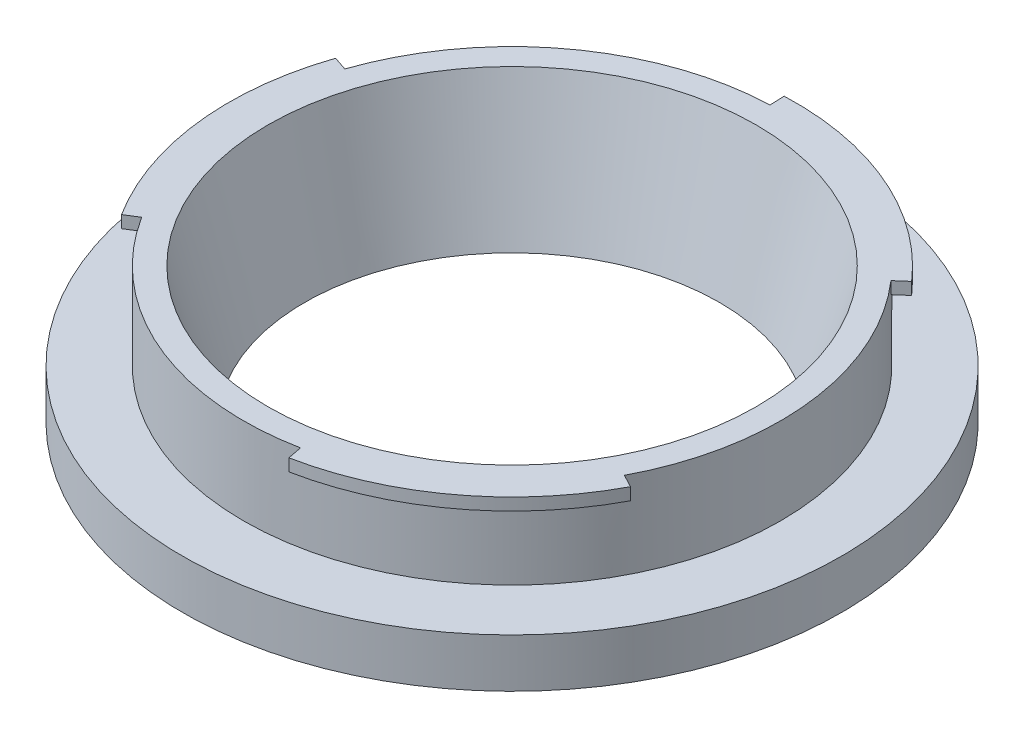
ISO-10303-21;
HEADER;
FILE_DESCRIPTION(('STEP AP214'),'2;1');
FILE_NAME('part.step','',(''),(''),'','','');
FILE_SCHEMA(('AUTOMOTIVE_DESIGN { 1 0 10303 214 1 1 1 1 }'));
ENDSEC;
DATA;
#1=APPLICATION_CONTEXT('core data for automotive mechanical design processes');
#2=APPLICATION_PROTOCOL_DEFINITION('international standard','automotive_design',2000,#1);
#3=PRODUCT_CONTEXT('',#1,'mechanical');
#4=PRODUCT('Part','Part','',(#3));
#5=PRODUCT_RELATED_PRODUCT_CATEGORY('part','',(#4));
#6=PRODUCT_DEFINITION_FORMATION('','',#4);
#7=PRODUCT_DEFINITION_CONTEXT('part definition',#1,'design');
#8=PRODUCT_DEFINITION('design','',#6,#7);
#9=PRODUCT_DEFINITION_SHAPE('','',#8);
#10=(LENGTH_UNIT() NAMED_UNIT(*) SI_UNIT(.MILLI.,.METRE.));
#11=(NAMED_UNIT(*) PLANE_ANGLE_UNIT() SI_UNIT($,.RADIAN.));
#12=(NAMED_UNIT(*) SI_UNIT($,.STERADIAN.) SOLID_ANGLE_UNIT());
#13=UNCERTAINTY_MEASURE_WITH_UNIT(LENGTH_MEASURE(1.E-05),#10,'distance_accuracy_value','');
#14=(GEOMETRIC_REPRESENTATION_CONTEXT(3) GLOBAL_UNCERTAINTY_ASSIGNED_CONTEXT((#13)) GLOBAL_UNIT_ASSIGNED_CONTEXT((#10,
#11,#12)) REPRESENTATION_CONTEXT('',''));
#15=CARTESIAN_POINT('',(0.,0.,0.));
#16=DIRECTION('',(0.,0.,1.));
#17=DIRECTION('',(1.,0.,0.));
#18=AXIS2_PLACEMENT_3D('',#15,#16,#17);
#19=CARTESIAN_POINT('',(0.,10.1,0.));
#20=DIRECTION('',(0.,-1.,0.));
#21=DIRECTION('',(0.,0.,-1.));
#22=AXIS2_PLACEMENT_3D('',#19,#20,#21);
#23=PLANE('',#22);
#24=CARTESIAN_POINT('',(0.,10.1,0.));
#25=DIRECTION('',(0.,-1.,0.));
#26=DIRECTION('',(0.,0.,-1.));
#27=AXIS2_PLACEMENT_3D('',#24,#25,#26);
#28=CIRCLE('',#27,22.);
#29=CARTESIAN_POINT('',(-0.844531799925527,10.1,-21.9837841610337));
#30=VERTEX_POINT('',#29);
#31=CARTESIAN_POINT('',(16.5699252925209,10.1,-14.4719582572738));
#32=VERTEX_POINT('',#31);
#33=EDGE_CURVE('E141',#30,#32,#28,.T.);
#34=ORIENTED_EDGE('',*,*,#33,.F.);
#35=DIRECTION('',(0.0383878090875239,0.,0.999262916410621));
#36=VECTOR('',#35,1.);
#37=CARTESIAN_POINT('',(0.,10.1,0.));
#38=LINE('',#37,#36);
#39=CARTESIAN_POINT('',(-0.890597170830556,10.1,-23.1828996607264));
#40=VERTEX_POINT('',#39);
#41=EDGE_CURVE('E126',#40,#30,#38,.T.);
#42=ORIENTED_EDGE('',*,*,#41,.F.);
#43=CARTESIAN_POINT('',(0.,10.1,0.));
#44=DIRECTION('',(0.,-1.,0.));
#45=DIRECTION('',(0.,0.,-1.));
#46=AXIS2_PLACEMENT_3D('',#43,#44,#45);
#47=CIRCLE('',#46,23.2);
#48=CARTESIAN_POINT('',(17.4737393993857,10.1,-15.2613377985796));
#49=VERTEX_POINT('',#48);
#50=EDGE_CURVE('E155',#40,#49,#47,.T.);
#51=ORIENTED_EDGE('',*,*,#50,.T.);
#52=DIRECTION('',(-0.753178422387314,0.,0.657816284421538));
#53=VECTOR('',#52,1.);
#54=CARTESIAN_POINT('',(0.,10.1,0.));
#55=LINE('',#54,#53);
#56=EDGE_CURVE('E146',#49,#32,#55,.T.);
#57=ORIENTED_EDGE('',*,*,#56,.T.);
#58=EDGE_LOOP('',(#34,#42,#51,#57));
#59=FACE_BOUND('',#58,.T.);
#60=ADVANCED_FACE('F37',(#59),#23,.T.);
#61=CARTESIAN_POINT('',(0.,0.,0.));
#62=DIRECTION('',(0.,-1.,0.));
#63=DIRECTION('',(0.,0.,-1.));
#64=AXIS2_PLACEMENT_3D('',#61,#62,#63);
#65=CYLINDRICAL_SURFACE('',#64,23.2);
#66=DIRECTION('',(0.,1.,0.));
#67=VECTOR('',#66,1.);
#68=CARTESIAN_POINT('',(-0.890597170830556,10.1,-23.1828996607264));
#69=LINE('',#68,#67);
#70=CARTESIAN_POINT('',(-0.890597170830556,11.1,-23.1828996607264));
#71=VERTEX_POINT('',#70);
#72=EDGE_CURVE('E131',#40,#71,#69,.T.);
#73=ORIENTED_EDGE('',*,*,#72,.T.);
#74=CARTESIAN_POINT('',(0.,11.1,0.));
#75=DIRECTION('',(0.,-1.,0.));
#76=DIRECTION('',(0.,0.,-1.));
#77=AXIS2_PLACEMENT_3D('',#74,#75,#76);
#78=CIRCLE('',#77,23.2);
#79=CARTESIAN_POINT('',(17.4737393993857,11.1,-15.2613377985796));
#80=VERTEX_POINT('',#79);
#81=EDGE_CURVE('E254',#71,#80,#78,.T.);
#82=ORIENTED_EDGE('',*,*,#81,.T.);
#83=DIRECTION('',(0.,1.,0.));
#84=VECTOR('',#83,1.);
#85=CARTESIAN_POINT('',(17.4737393993857,10.1,-15.2613377985796));
#86=LINE('',#85,#84);
#87=EDGE_CURVE('E241',#49,#80,#86,.T.);
#88=ORIENTED_EDGE('',*,*,#87,.F.);
#89=ORIENTED_EDGE('',*,*,#50,.F.);
#90=EDGE_LOOP('',(#73,#82,#88,#89));
#91=FACE_BOUND('',#90,.T.);
#92=ADVANCED_FACE('F179',(#91),#65,.T.);
#93=DIRECTION('',(0.946274824525796,0.,0.323363505158938));
#94=VECTOR('',#93,1.);
#95=CARTESIAN_POINT('',(0.,10.1,0.));
#96=LINE('',#95,#94);
#97=CARTESIAN_POINT('',(-21.9535759289984,10.1,-7.50203331968743));
#98=VERTEX_POINT('',#97);
#99=CARTESIAN_POINT('',(-20.8180461395675,10.1,-7.11399711349671));
#100=VERTEX_POINT('',#99);
#101=EDGE_CURVE('E135',#98,#100,#96,.T.);
#102=ORIENTED_EDGE('',*,*,#101,.T.);
#103=CARTESIAN_POINT('',(-18.6162496548065,10.1,11.723278073556));
#104=VERTEX_POINT('',#103);
#105=EDGE_CURVE('E147',#104,#100,#28,.T.);
#106=ORIENTED_EDGE('',*,*,#105,.F.);
#107=DIRECTION('',(0.846193166127566,0.,-0.532876276070727));
#108=VECTOR('',#107,1.);
#109=CARTESIAN_POINT('',(0.,10.1,0.));
#110=LINE('',#109,#108);
#111=CARTESIAN_POINT('',(-19.6316814541596,10.1,12.3627296048408));
#112=VERTEX_POINT('',#111);
#113=EDGE_CURVE('E205',#112,#104,#110,.T.);
#114=ORIENTED_EDGE('',*,*,#113,.F.);
#115=EDGE_CURVE('E153',#112,#98,#47,.T.);
#116=ORIENTED_EDGE('',*,*,#115,.T.);
#117=EDGE_LOOP('',(#102,#106,#114,#116));
#118=FACE_BOUND('',#117,.T.);
#119=ADVANCED_FACE('F181',(#118),#23,.T.);
#120=CARTESIAN_POINT('',(-19.6316814541596,11.1,12.3627296048408));
#121=VERTEX_POINT('',#120);
#122=CARTESIAN_POINT('',(-21.9535759289984,11.1,-7.50203331968743));
#123=VERTEX_POINT('',#122);
#124=EDGE_CURVE('E257',#121,#123,#78,.T.);
#125=ORIENTED_EDGE('',*,*,#124,.T.);
#126=DIRECTION('',(0.,1.,0.));
#127=VECTOR('',#126,1.);
#128=CARTESIAN_POINT('',(-21.9535759289984,10.1,-7.50203331968743));
#129=LINE('',#128,#127);
#130=EDGE_CURVE('E280',#98,#123,#129,.T.);
#131=ORIENTED_EDGE('',*,*,#130,.F.);
#132=ORIENTED_EDGE('',*,*,#115,.F.);
#133=DIRECTION('',(0.,1.,0.));
#134=VECTOR('',#133,1.);
#135=CARTESIAN_POINT('',(-19.6316814541596,10.1,12.3627296048408));
#136=LINE('',#135,#134);
#137=EDGE_CURVE('E207',#112,#121,#136,.T.);
#138=ORIENTED_EDGE('',*,*,#137,.T.);
#139=EDGE_LOOP('',(#125,#131,#132,#138));
#140=FACE_BOUND('',#139,.T.);
#141=ADVANCED_FACE('F187',(#140),#65,.T.);
#142=CARTESIAN_POINT('',(0.,0.,0.));
#143=DIRECTION('',(0.,-1.,0.));
#144=DIRECTION('',(0.,0.,-1.));
#145=AXIS2_PLACEMENT_3D('',#142,#143,#144);
#146=PLANE('',#145);
#147=CARTESIAN_POINT('',(0.,0.,0.));
#148=DIRECTION('',(0.,-1.,0.));
#149=DIRECTION('',(0.,0.,-1.));
#150=AXIS2_PLACEMENT_3D('',#147,#148,#149);
#151=CIRCLE('',#150,27.);
#152=CARTESIAN_POINT('',(0.,0.,-27.));
#153=VERTEX_POINT('',#152);
#154=EDGE_CURVE('E11',#153,#153,#151,.T.);
#155=ORIENTED_EDGE('',*,*,#154,.T.);
#156=EDGE_LOOP('',(#155));
#157=FACE_BOUND('',#156,.T.);
#158=CARTESIAN_POINT('',(0.,0.,0.));
#159=DIRECTION('',(0.,-1.,0.));
#160=DIRECTION('',(0.,0.,-1.));
#161=AXIS2_PLACEMENT_3D('',#158,#159,#160);
#162=CIRCLE('',#161,17.);
#163=CARTESIAN_POINT('',(0.,0.,-17.));
#164=VERTEX_POINT('',#163);
#165=EDGE_CURVE('E240',#164,#164,#162,.T.);
#166=ORIENTED_EDGE('',*,*,#165,.F.);
#167=EDGE_LOOP('',(#166));
#168=FACE_BOUND('',#167,.T.);
#169=ADVANCED_FACE('F39',(#157,#168),#146,.T.);
#170=CARTESIAN_POINT('',(0.,0.,0.));
#171=DIRECTION('',(0.,-1.,0.));
#172=DIRECTION('',(0.,0.,-1.));
#173=AXIS2_PLACEMENT_3D('',#170,#171,#172);
#174=CYLINDRICAL_SURFACE('',#173,27.);
#175=CARTESIAN_POINT('',(0.,4.,0.));
#176=DIRECTION('',(0.,-1.,0.));
#177=DIRECTION('',(0.,0.,-1.));
#178=AXIS2_PLACEMENT_3D('',#175,#176,#177);
#179=CIRCLE('',#178,27.);
#180=CARTESIAN_POINT('',(0.,4.,-27.));
#181=VERTEX_POINT('',#180);
#182=EDGE_CURVE('E45',#181,#181,#179,.T.);
#183=ORIENTED_EDGE('',*,*,#182,.T.);
#184=EDGE_LOOP('',(#183));
#185=FACE_BOUND('',#184,.T.);
#186=ORIENTED_EDGE('',*,*,#154,.F.);
#187=EDGE_LOOP('',(#186));
#188=FACE_BOUND('',#187,.T.);
#189=ADVANCED_FACE('F166',(#185,#188),#174,.T.);
#190=CARTESIAN_POINT('',(0.,4.,0.));
#191=DIRECTION('',(0.,-1.,0.));
#192=DIRECTION('',(0.,0.,-1.));
#193=AXIS2_PLACEMENT_3D('',#190,#191,#192);
#194=PLANE('',#193);
#195=ORIENTED_EDGE('',*,*,#182,.F.);
#196=EDGE_LOOP('',(#195));
#197=FACE_BOUND('',#196,.T.);
#198=CARTESIAN_POINT('',(0.,4.,0.));
#199=DIRECTION('',(0.,-1.,0.));
#200=DIRECTION('',(0.,0.,-1.));
#201=AXIS2_PLACEMENT_3D('',#198,#199,#200);
#202=CIRCLE('',#201,22.);
#203=CARTESIAN_POINT('',(0.,4.,-22.));
#204=VERTEX_POINT('',#203);
#205=EDGE_CURVE('E157',#204,#204,#202,.T.);
#206=ORIENTED_EDGE('',*,*,#205,.T.);
#207=EDGE_LOOP('',(#206));
#208=FACE_BOUND('',#207,.T.);
#209=ADVANCED_FACE('F169',(#197,#208),#194,.F.);
#210=CARTESIAN_POINT('',(0.,0.,0.));
#211=DIRECTION('',(0.,-1.,0.));
#212=DIRECTION('',(0.,0.,-1.));
#213=AXIS2_PLACEMENT_3D('',#210,#211,#212);
#214=CYLINDRICAL_SURFACE('',#213,22.);
#215=CARTESIAN_POINT('',(19.4607814547318,10.1,10.2605060874776));
#216=VERTEX_POINT('',#215);
#217=CARTESIAN_POINT('',(4.24812084704652,10.1,21.5859553707703));
#218=VERTEX_POINT('',#217);
#219=EDGE_CURVE('E150',#216,#218,#28,.T.);
#220=ORIENTED_EDGE('',*,*,#219,.T.);
#221=DIRECTION('',(0.,1.,0.));
#222=VECTOR('',#221,1.);
#223=CARTESIAN_POINT('',(4.24812084704652,10.1,21.5859553707703));
#224=LINE('',#223,#222);
#225=CARTESIAN_POINT('',(4.24812084704652,11.1,21.5859553707703));
#226=VERTEX_POINT('',#225);
#227=EDGE_CURVE('E219',#218,#226,#224,.T.);
#228=ORIENTED_EDGE('',*,*,#227,.T.);
#229=CARTESIAN_POINT('',(0.,11.1,0.));
#230=DIRECTION('',(0.,1.,0.));
#231=DIRECTION('',(0.,0.,1.));
#232=AXIS2_PLACEMENT_3D('',#229,#230,#231);
#233=CIRCLE('',#232,22.);
#234=CARTESIAN_POINT('',(-18.6162496548065,11.1,11.723278073556));
#235=VERTEX_POINT('',#234);
#236=EDGE_CURVE('E59',#235,#226,#233,.T.);
#237=ORIENTED_EDGE('',*,*,#236,.F.);
#238=DIRECTION('',(0.,1.,0.));
#239=VECTOR('',#238,1.);
#240=CARTESIAN_POINT('',(-18.6162496548065,10.1,11.723278073556));
#241=LINE('',#240,#239);
#242=EDGE_CURVE('E204',#104,#235,#241,.T.);
#243=ORIENTED_EDGE('',*,*,#242,.F.);
#244=ORIENTED_EDGE('',*,*,#105,.T.);
#245=DIRECTION('',(0.,1.,0.));
#246=VECTOR('',#245,1.);
#247=CARTESIAN_POINT('',(-20.8180461395675,10.1,-7.11399711349671));
#248=LINE('',#247,#246);
#249=CARTESIAN_POINT('',(-20.8180461395675,11.1,-7.11399711349671));
#250=VERTEX_POINT('',#249);
#251=EDGE_CURVE('E214',#100,#250,#248,.T.);
#252=ORIENTED_EDGE('',*,*,#251,.T.);
#253=CARTESIAN_POINT('',(0.,11.1,0.));
#254=DIRECTION('',(0.,1.,0.));
#255=DIRECTION('',(0.,0.,1.));
#256=AXIS2_PLACEMENT_3D('',#253,#254,#255);
#257=CIRCLE('',#256,22.);
#258=CARTESIAN_POINT('',(-0.844531799925527,11.1,-21.9837841610337));
#259=VERTEX_POINT('',#258);
#260=EDGE_CURVE('E52',#259,#250,#257,.T.);
#261=ORIENTED_EDGE('',*,*,#260,.F.);
#262=DIRECTION('',(0.,1.,0.));
#263=VECTOR('',#262,1.);
#264=CARTESIAN_POINT('',(-0.844531799925527,10.1,-21.9837841610337));
#265=LINE('',#264,#263);
#266=EDGE_CURVE('E128',#30,#259,#265,.T.);
#267=ORIENTED_EDGE('',*,*,#266,.F.);
#268=ORIENTED_EDGE('',*,*,#33,.T.);
#269=DIRECTION('',(0.,1.,0.));
#270=VECTOR('',#269,1.);
#271=CARTESIAN_POINT('',(16.5699252925209,10.1,-14.4719582572738));
#272=LINE('',#271,#270);
#273=CARTESIAN_POINT('',(16.5699252925209,11.1,-14.4719582572738));
#274=VERTEX_POINT('',#273);
#275=EDGE_CURVE('E238',#32,#274,#272,.T.);
#276=ORIENTED_EDGE('',*,*,#275,.T.);
#277=CARTESIAN_POINT('',(0.,11.1,0.));
#278=DIRECTION('',(0.,1.,0.));
#279=DIRECTION('',(0.,0.,1.));
#280=AXIS2_PLACEMENT_3D('',#277,#278,#279);
#281=CIRCLE('',#280,22.);
#282=CARTESIAN_POINT('',(19.4607814547318,11.1,10.2605060874776));
#283=VERTEX_POINT('',#282);
#284=EDGE_CURVE('E221',#283,#274,#281,.T.);
#285=ORIENTED_EDGE('',*,*,#284,.F.);
#286=DIRECTION('',(0.,1.,0.));
#287=VECTOR('',#286,1.);
#288=CARTESIAN_POINT('',(19.4607814547318,10.1,10.2605060874776));
#289=LINE('',#288,#287);
#290=EDGE_CURVE('E230',#216,#283,#289,.T.);
#291=ORIENTED_EDGE('',*,*,#290,.F.);
#292=EDGE_LOOP('',(#220,#228,#237,#243,#244,#252,#261,#267,#268,#276,#285,#291));
#293=FACE_BOUND('',#292,.T.);
#294=ORIENTED_EDGE('',*,*,#205,.F.);
#295=EDGE_LOOP('',(#294));
#296=FACE_BOUND('',#295,.T.);
#297=ADVANCED_FACE('F139',(#293,#296),#214,.T.);
#298=DIRECTION('',(-0.193096402138482,0.,-0.981179789580469));
#299=VECTOR('',#298,1.);
#300=CARTESIAN_POINT('',(0.,10.1,0.));
#301=LINE('',#300,#299);
#302=CARTESIAN_POINT('',(4.4798365296127,10.1,22.7633711182669));
#303=VERTEX_POINT('',#302);
#304=EDGE_CURVE('E199',#303,#218,#301,.T.);
#305=ORIENTED_EDGE('',*,*,#304,.T.);
#306=ORIENTED_EDGE('',*,*,#219,.F.);
#307=DIRECTION('',(-0.884580975215084,0.,-0.466386640339891));
#308=VECTOR('',#307,1.);
#309=CARTESIAN_POINT('',(0.,10.1,0.));
#310=LINE('',#309,#308);
#311=CARTESIAN_POINT('',(20.5222786249899,10.1,10.8201700558855));
#312=VERTEX_POINT('',#311);
#313=EDGE_CURVE('E226',#312,#216,#310,.T.);
#314=ORIENTED_EDGE('',*,*,#313,.F.);
#315=EDGE_CURVE('E148',#312,#303,#47,.T.);
#316=ORIENTED_EDGE('',*,*,#315,.T.);
#317=EDGE_LOOP('',(#305,#306,#314,#316));
#318=FACE_BOUND('',#317,.T.);
#319=ADVANCED_FACE('F176',(#318),#23,.T.);
#320=CARTESIAN_POINT('',(20.5222786249899,11.1,10.8201700558855));
#321=VERTEX_POINT('',#320);
#322=CARTESIAN_POINT('',(4.4798365296127,11.1,22.7633711182669));
#323=VERTEX_POINT('',#322);
#324=EDGE_CURVE('E255',#321,#323,#78,.T.);
#325=ORIENTED_EDGE('',*,*,#324,.T.);
#326=DIRECTION('',(0.,1.,0.));
#327=VECTOR('',#326,1.);
#328=CARTESIAN_POINT('',(4.4798365296127,10.1,22.7633711182669));
#329=LINE('',#328,#327);
#330=EDGE_CURVE('E222',#303,#323,#329,.T.);
#331=ORIENTED_EDGE('',*,*,#330,.F.);
#332=ORIENTED_EDGE('',*,*,#315,.F.);
#333=DIRECTION('',(0.,1.,0.));
#334=VECTOR('',#333,1.);
#335=CARTESIAN_POINT('',(20.5222786249899,10.1,10.8201700558855));
#336=LINE('',#335,#334);
#337=EDGE_CURVE('E244',#312,#321,#336,.T.);
#338=ORIENTED_EDGE('',*,*,#337,.T.);
#339=EDGE_LOOP('',(#325,#331,#332,#338));
#340=FACE_BOUND('',#339,.T.);
#341=ADVANCED_FACE('F188',(#340),#65,.T.);
#342=CARTESIAN_POINT('',(0.,11.1,0.));
#343=DIRECTION('',(0.,-1.,0.));
#344=DIRECTION('',(0.,0.,-1.));
#345=AXIS2_PLACEMENT_3D('',#342,#343,#344);
#346=PLANE('',#345);
#347=ORIENTED_EDGE('',*,*,#260,.T.);
#348=DIRECTION('',(0.946274824525796,0.,0.323363505158938));
#349=VECTOR('',#348,1.);
#350=CARTESIAN_POINT('',(0.,11.1,0.));
#351=LINE('',#350,#349);
#352=EDGE_CURVE('E136',#123,#250,#351,.T.);
#353=ORIENTED_EDGE('',*,*,#352,.F.);
#354=ORIENTED_EDGE('',*,*,#124,.F.);
#355=DIRECTION('',(0.846193166127566,0.,-0.532876276070727));
#356=VECTOR('',#355,1.);
#357=CARTESIAN_POINT('',(0.,11.1,0.));
#358=LINE('',#357,#356);
#359=EDGE_CURVE('E213',#121,#235,#358,.T.);
#360=ORIENTED_EDGE('',*,*,#359,.T.);
#361=ORIENTED_EDGE('',*,*,#236,.T.);
#362=DIRECTION('',(-0.193096402138482,0.,-0.981179789580469));
#363=VECTOR('',#362,1.);
#364=CARTESIAN_POINT('',(0.,11.1,0.));
#365=LINE('',#364,#363);
#366=EDGE_CURVE('E209',#323,#226,#365,.T.);
#367=ORIENTED_EDGE('',*,*,#366,.F.);
#368=ORIENTED_EDGE('',*,*,#324,.F.);
#369=DIRECTION('',(-0.884580975215084,0.,-0.466386640339891));
#370=VECTOR('',#369,1.);
#371=CARTESIAN_POINT('',(0.,11.1,0.));
#372=LINE('',#371,#370);
#373=EDGE_CURVE('E233',#321,#283,#372,.T.);
#374=ORIENTED_EDGE('',*,*,#373,.T.);
#375=ORIENTED_EDGE('',*,*,#284,.T.);
#376=DIRECTION('',(-0.753178422387314,0.,0.657816284421538));
#377=VECTOR('',#376,1.);
#378=CARTESIAN_POINT('',(0.,11.1,0.));
#379=LINE('',#378,#377);
#380=EDGE_CURVE('E228',#80,#274,#379,.T.);
#381=ORIENTED_EDGE('',*,*,#380,.F.);
#382=ORIENTED_EDGE('',*,*,#81,.F.);
#383=DIRECTION('',(0.0383878090875239,0.,0.999262916410621));
#384=VECTOR('',#383,1.);
#385=CARTESIAN_POINT('',(0.,11.1,0.));
#386=LINE('',#385,#384);
#387=EDGE_CURVE('E287',#71,#259,#386,.T.);
#388=ORIENTED_EDGE('',*,*,#387,.T.);
#389=EDGE_LOOP('',(#347,#353,#354,#360,#361,#367,#368,#374,#375,#381,#382,#388));
#390=FACE_BOUND('',#389,.T.);
#391=CARTESIAN_POINT('',(0.,11.1,0.));
#392=DIRECTION('',(0.,-1.,0.));
#393=DIRECTION('',(0.,0.,-1.));
#394=AXIS2_PLACEMENT_3D('',#391,#392,#393);
#395=CIRCLE('',#394,20.);
#396=CARTESIAN_POINT('',(0.,11.1,-20.));
#397=VERTEX_POINT('',#396);
#398=EDGE_CURVE('E251',#397,#397,#395,.T.);
#399=ORIENTED_EDGE('',*,*,#398,.T.);
#400=EDGE_LOOP('',(#399));
#401=FACE_BOUND('',#400,.T.);
#402=ADVANCED_FACE('F196',(#390,#401),#346,.F.);
#403=CARTESIAN_POINT('',(0.,0.,0.));
#404=DIRECTION('',(0.,1.,0.));
#405=DIRECTION('',(0.,0.,1.));
#406=AXIS2_PLACEMENT_3D('',#403,#404,#405);
#407=CONICAL_SURFACE('',#406,17.,0.263963723625705);
#408=ORIENTED_EDGE('',*,*,#398,.F.);
#409=EDGE_LOOP('',(#408));
#410=FACE_BOUND('',#409,.T.);
#411=ORIENTED_EDGE('',*,*,#165,.T.);
#412=EDGE_LOOP('',(#411));
#413=FACE_BOUND('',#412,.T.);
#414=ADVANCED_FACE('F307',(#410,#413),#407,.F.);
#415=CARTESIAN_POINT('',(0.,10.1,0.));
#416=DIRECTION('',(-0.657816284421538,0.,-0.753178422387314));
#417=DIRECTION('',(-0.753178422387314,0.,0.657816284421538));
#418=AXIS2_PLACEMENT_3D('',#415,#416,#417);
#419=PLANE('',#418);
#420=ORIENTED_EDGE('',*,*,#380,.T.);
#421=ORIENTED_EDGE('',*,*,#275,.F.);
#422=ORIENTED_EDGE('',*,*,#56,.F.);
#423=ORIENTED_EDGE('',*,*,#87,.T.);
#424=EDGE_LOOP('',(#420,#421,#422,#423));
#425=FACE_BOUND('',#424,.T.);
#426=ADVANCED_FACE('F265',(#425),#419,.F.);
#427=CARTESIAN_POINT('',(0.,10.1,0.));
#428=DIRECTION('',(0.466386640339891,0.,-0.884580975215084));
#429=DIRECTION('',(-0.884580975215084,0.,-0.466386640339891));
#430=AXIS2_PLACEMENT_3D('',#427,#428,#429);
#431=PLANE('',#430);
#432=ORIENTED_EDGE('',*,*,#373,.F.);
#433=ORIENTED_EDGE('',*,*,#337,.F.);
#434=ORIENTED_EDGE('',*,*,#313,.T.);
#435=ORIENTED_EDGE('',*,*,#290,.T.);
#436=EDGE_LOOP('',(#432,#433,#434,#435));
#437=FACE_BOUND('',#436,.T.);
#438=ADVANCED_FACE('F268',(#437),#431,.T.);
#439=CARTESIAN_POINT('',(0.,10.1,0.));
#440=DIRECTION('',(0.981179789580469,0.,-0.193096402138482));
#441=DIRECTION('',(-0.193096402138482,0.,-0.981179789580469));
#442=AXIS2_PLACEMENT_3D('',#439,#440,#441);
#443=PLANE('',#442);
#444=ORIENTED_EDGE('',*,*,#366,.T.);
#445=ORIENTED_EDGE('',*,*,#227,.F.);
#446=ORIENTED_EDGE('',*,*,#304,.F.);
#447=ORIENTED_EDGE('',*,*,#330,.T.);
#448=EDGE_LOOP('',(#444,#445,#446,#447));
#449=FACE_BOUND('',#448,.T.);
#450=ADVANCED_FACE('F270',(#449),#443,.F.);
#451=CARTESIAN_POINT('',(0.,10.1,0.));
#452=DIRECTION('',(0.532876276070727,0.,0.846193166127566));
#453=DIRECTION('',(0.846193166127566,0.,-0.532876276070727));
#454=AXIS2_PLACEMENT_3D('',#451,#452,#453);
#455=PLANE('',#454);
#456=ORIENTED_EDGE('',*,*,#359,.F.);
#457=ORIENTED_EDGE('',*,*,#137,.F.);
#458=ORIENTED_EDGE('',*,*,#113,.T.);
#459=ORIENTED_EDGE('',*,*,#242,.T.);
#460=EDGE_LOOP('',(#456,#457,#458,#459));
#461=FACE_BOUND('',#460,.T.);
#462=ADVANCED_FACE('F274',(#461),#455,.T.);
#463=CARTESIAN_POINT('',(0.,10.1,0.));
#464=DIRECTION('',(-0.323363505158938,0.,0.946274824525796));
#465=DIRECTION('',(0.946274824525796,0.,0.323363505158938));
#466=AXIS2_PLACEMENT_3D('',#463,#464,#465);
#467=PLANE('',#466);
#468=ORIENTED_EDGE('',*,*,#352,.T.);
#469=ORIENTED_EDGE('',*,*,#251,.F.);
#470=ORIENTED_EDGE('',*,*,#101,.F.);
#471=ORIENTED_EDGE('',*,*,#130,.T.);
#472=EDGE_LOOP('',(#468,#469,#470,#471));
#473=FACE_BOUND('',#472,.T.);
#474=ADVANCED_FACE('F286',(#473),#467,.F.);
#475=CARTESIAN_POINT('',(0.,10.1,0.));
#476=DIRECTION('',(-0.999262916410621,0.,0.0383878090875239));
#477=DIRECTION('',(0.0383878090875239,0.,0.999262916410621));
#478=AXIS2_PLACEMENT_3D('',#475,#476,#477);
#479=PLANE('',#478);
#480=ORIENTED_EDGE('',*,*,#387,.F.);
#481=ORIENTED_EDGE('',*,*,#72,.F.);
#482=ORIENTED_EDGE('',*,*,#41,.T.);
#483=ORIENTED_EDGE('',*,*,#266,.T.);
#484=EDGE_LOOP('',(#480,#481,#482,#483));
#485=FACE_BOUND('',#484,.T.);
#486=ADVANCED_FACE('F127',(#485),#479,.T.);
#487=CLOSED_SHELL('',(#60,#92,#119,#141,#169,#189,#209,#297,#319,#341,#402,#414,#426,#438,#450,
#462,#474,#486));
#488=MANIFOLD_SOLID_BREP('B2',#487);
#489=ADVANCED_BREP_SHAPE_REPRESENTATION('',(#18,#488),#14);
#490=SHAPE_DEFINITION_REPRESENTATION(#9,#489);
ENDSEC;
END-ISO-10303-21;
